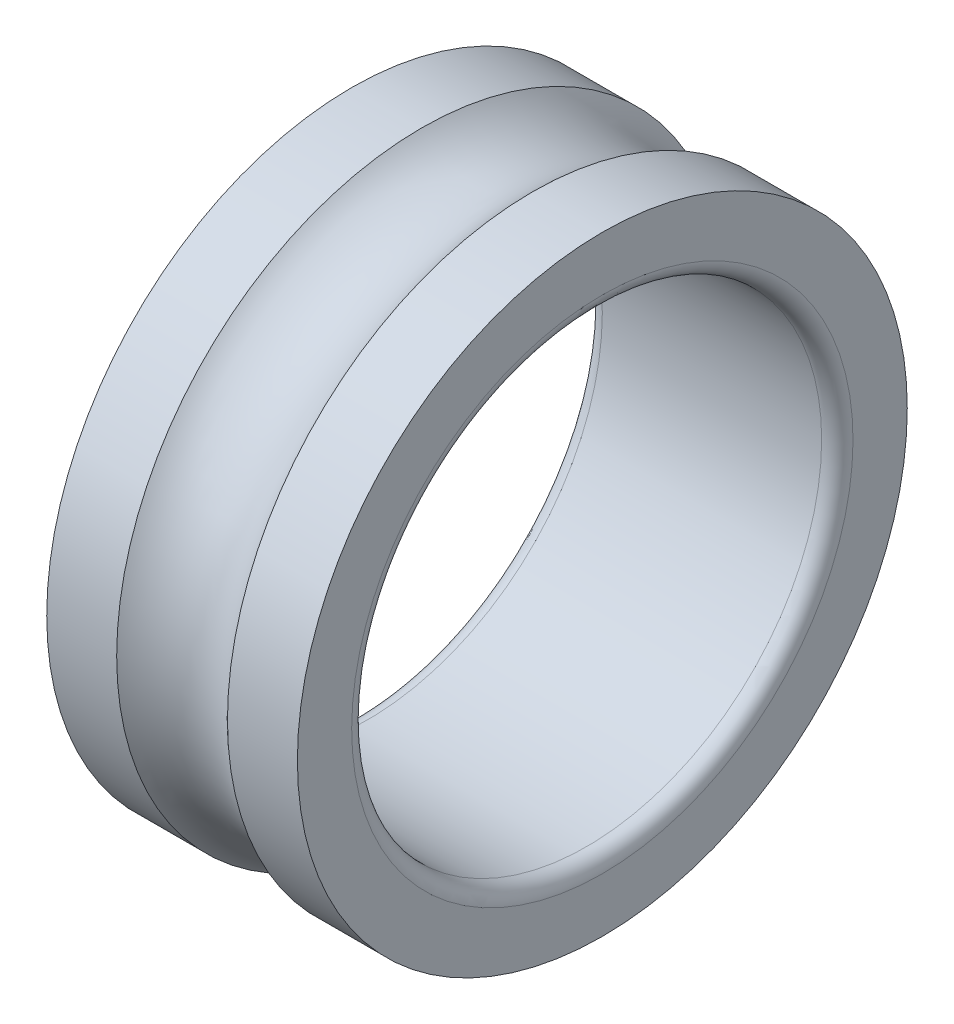
ISO-10303-21;
HEADER;
FILE_DESCRIPTION(('STEP AP214'),'2;1');
FILE_NAME('part.step','',(''),(''),'','','');
FILE_SCHEMA(('AUTOMOTIVE_DESIGN { 1 0 10303 214 1 1 1 1 }'));
ENDSEC;
DATA;
#1=APPLICATION_CONTEXT('core data for automotive mechanical design processes');
#2=APPLICATION_PROTOCOL_DEFINITION('international standard','automotive_design',2000,#1);
#3=PRODUCT_CONTEXT('',#1,'mechanical');
#4=PRODUCT('Part','Part','',(#3));
#5=PRODUCT_RELATED_PRODUCT_CATEGORY('part','',(#4));
#6=PRODUCT_DEFINITION_FORMATION('','',#4);
#7=PRODUCT_DEFINITION_CONTEXT('part definition',#1,'design');
#8=PRODUCT_DEFINITION('design','',#6,#7);
#9=PRODUCT_DEFINITION_SHAPE('','',#8);
#10=(LENGTH_UNIT() NAMED_UNIT(*) SI_UNIT(.MILLI.,.METRE.));
#11=(NAMED_UNIT(*) PLANE_ANGLE_UNIT() SI_UNIT($,.RADIAN.));
#12=(NAMED_UNIT(*) SI_UNIT($,.STERADIAN.) SOLID_ANGLE_UNIT());
#13=UNCERTAINTY_MEASURE_WITH_UNIT(LENGTH_MEASURE(1.E-05),#10,'distance_accuracy_value','');
#14=(GEOMETRIC_REPRESENTATION_CONTEXT(3) GLOBAL_UNCERTAINTY_ASSIGNED_CONTEXT((#13)) GLOBAL_UNIT_ASSIGNED_CONTEXT((#10,
#11,#12)) REPRESENTATION_CONTEXT('',''));
#15=CARTESIAN_POINT('',(0.,0.,0.));
#16=DIRECTION('',(0.,0.,1.));
#17=DIRECTION('',(1.,0.,0.));
#18=AXIS2_PLACEMENT_3D('',#15,#16,#17);
#19=CARTESIAN_POINT('',(25.9943089574791,0.,0.));
#20=DIRECTION('',(-1.,0.,0.));
#21=DIRECTION('',(0.,0.877582561890372,-0.479425538604204));
#22=AXIS2_PLACEMENT_3D('',#19,#20,#21);
#23=TOROIDAL_SURFACE('',#22,23.,5.);
#24=CARTESIAN_POINT('',(22.4587750515691,0.,0.));
#25=DIRECTION('',(1.,0.,0.));
#26=DIRECTION('',(0.,0.,-1.));
#27=AXIS2_PLACEMENT_3D('',#24,#25,#26);
#28=CIRCLE('',#27,19.4644660941);
#29=CARTESIAN_POINT('',(22.4587750515691,0.,-19.4644660941));
#30=VERTEX_POINT('',#29);
#31=EDGE_CURVE('E258',#30,#30,#28,.F.);
#32=ORIENTED_EDGE('',*,*,#31,.F.);
#33=EDGE_LOOP('',(#32));
#34=FACE_BOUND('',#33,.T.);
#35=CARTESIAN_POINT('',(29.5298428634091,0.,0.));
#36=DIRECTION('',(1.,0.,0.));
#37=DIRECTION('',(0.,0.,-1.));
#38=AXIS2_PLACEMENT_3D('',#35,#36,#37);
#39=CIRCLE('',#38,19.4644660941);
#40=CARTESIAN_POINT('',(29.5298428634091,0.,-19.4644660941));
#41=VERTEX_POINT('',#40);
#42=EDGE_CURVE('E255',#41,#41,#39,.T.);
#43=ORIENTED_EDGE('',*,*,#42,.F.);
#44=EDGE_LOOP('',(#43));
#45=FACE_BOUND('',#44,.T.);
#46=ADVANCED_FACE('F17',(#34,#45),#23,.F.);
#47=CARTESIAN_POINT('',(25.9943089573691,0.,0.));
#48=DIRECTION('',(1.,0.,0.));
#49=DIRECTION('',(0.,0.,-1.));
#50=AXIS2_PLACEMENT_3D('',#47,#48,#49);
#51=CYLINDRICAL_SURFACE('',#50,19.4644660941);
#52=CARTESIAN_POINT('',(17.9943089574691,0.,0.));
#53=DIRECTION('',(1.,0.,0.));
#54=DIRECTION('',(0.,0.,-1.));
#55=AXIS2_PLACEMENT_3D('',#52,#53,#54);
#56=CIRCLE('',#55,19.4644660941);
#57=CARTESIAN_POINT('',(17.9943089574691,0.,-19.4644660941));
#58=VERTEX_POINT('',#57);
#59=EDGE_CURVE('E252',#58,#58,#56,.F.);
#60=ORIENTED_EDGE('',*,*,#59,.F.);
#61=EDGE_LOOP('',(#60));
#62=FACE_BOUND('',#61,.T.);
#63=ORIENTED_EDGE('',*,*,#31,.T.);
#64=EDGE_LOOP('',(#63));
#65=FACE_BOUND('',#64,.T.);
#66=ADVANCED_FACE('F130',(#62,#65),#51,.T.);
#67=CARTESIAN_POINT('',(25.9943089573691,0.,0.));
#68=DIRECTION('',(1.,0.,0.));
#69=DIRECTION('',(0.,0.,-1.));
#70=AXIS2_PLACEMENT_3D('',#67,#68,#69);
#71=CYLINDRICAL_SURFACE('',#70,19.4644660941);
#72=ORIENTED_EDGE('',*,*,#42,.T.);
#73=EDGE_LOOP('',(#72));
#74=FACE_BOUND('',#73,.T.);
#75=CARTESIAN_POINT('',(33.9943089574791,0.,0.));
#76=DIRECTION('',(1.,0.,0.));
#77=DIRECTION('',(0.,0.,-1.));
#78=AXIS2_PLACEMENT_3D('',#75,#76,#77);
#79=CIRCLE('',#78,19.4644660941);
#80=CARTESIAN_POINT('',(33.9943089574791,0.,-19.4644660941));
#81=VERTEX_POINT('',#80);
#82=EDGE_CURVE('E250',#81,#81,#79,.F.);
#83=ORIENTED_EDGE('',*,*,#82,.T.);
#84=EDGE_LOOP('',(#83));
#85=FACE_BOUND('',#84,.T.);
#86=ADVANCED_FACE('F127',(#74,#85),#71,.T.);
#87=CARTESIAN_POINT('',(17.9943089574691,30.,0.));
#88=DIRECTION('',(-1.,0.,0.));
#89=DIRECTION('',(0.,0.,1.));
#90=AXIS2_PLACEMENT_3D('',#87,#88,#89);
#91=PLANE('',#90);
#92=CARTESIAN_POINT('',(17.9943089574691,0.,0.));
#93=DIRECTION('',(-1.,0.,0.));
#94=DIRECTION('',(0.,-0.877582561891139,0.479425538602801));
#95=AXIS2_PLACEMENT_3D('',#92,#93,#94);
#96=CIRCLE('',#95,16.0000000000244);
#97=CARTESIAN_POINT('',(17.9943089574691,-14.0413209902833,7.67080861765993));
#98=VERTEX_POINT('',#97);
#99=CARTESIAN_POINT('',(17.9943089574691,14.0413209902545,-7.67080861767194));
#100=VERTEX_POINT('',#99);
#101=EDGE_CURVE('E53',#98,#100,#96,.T.);
#102=ORIENTED_EDGE('',*,*,#101,.F.);
#103=CARTESIAN_POINT('',(17.9943089574691,0.,0.));
#104=DIRECTION('',(-1.,0.,0.));
#105=DIRECTION('',(0.,0.877582561890372,-0.479425538604204));
#106=AXIS2_PLACEMENT_3D('',#103,#104,#105);
#107=CIRCLE('',#106,16.);
#108=EDGE_CURVE('E48',#100,#98,#107,.T.);
#109=ORIENTED_EDGE('',*,*,#108,.F.);
#110=EDGE_LOOP('',(#102,#109));
#111=FACE_BOUND('',#110,.T.);
#112=ORIENTED_EDGE('',*,*,#59,.T.);
#113=EDGE_LOOP('',(#112));
#114=FACE_BOUND('',#113,.T.);
#115=ADVANCED_FACE('F51',(#111,#114),#91,.T.);
#116=CARTESIAN_POINT('',(33.9943089574791,26.5355339059,0.));
#117=DIRECTION('',(-1.,0.,0.));
#118=DIRECTION('',(0.,0.,1.));
#119=AXIS2_PLACEMENT_3D('',#116,#117,#118);
#120=PLANE('',#119);
#121=CARTESIAN_POINT('',(33.9943089574791,0.,0.));
#122=DIRECTION('',(1.,0.,0.));
#123=DIRECTION('',(0.,0.877582561890372,-0.479425538604204));
#124=AXIS2_PLACEMENT_3D('',#121,#122,#123);
#125=CIRCLE('',#124,15.9999999999805);
#126=CARTESIAN_POINT('',(33.9943089574791,14.0413209902207,-7.67080861766462));
#127=VERTEX_POINT('',#126);
#128=CARTESIAN_POINT('',(33.9943089574791,-14.0413209902431,7.67080861766027));
#129=VERTEX_POINT('',#128);
#130=EDGE_CURVE('E35',#127,#129,#125,.T.);
#131=ORIENTED_EDGE('',*,*,#130,.F.);
#132=CARTESIAN_POINT('',(33.9943089574791,0.,0.));
#133=DIRECTION('',(1.,0.,0.));
#134=DIRECTION('',(0.,-0.877582561890729,0.47942553860355));
#135=AXIS2_PLACEMENT_3D('',#132,#133,#134);
#136=CIRCLE('',#135,16.);
#137=EDGE_CURVE('E39',#129,#127,#136,.T.);
#138=ORIENTED_EDGE('',*,*,#137,.F.);
#139=EDGE_LOOP('',(#131,#138));
#140=FACE_BOUND('',#139,.T.);
#141=ORIENTED_EDGE('',*,*,#82,.F.);
#142=EDGE_LOOP('',(#141));
#143=FACE_BOUND('',#142,.T.);
#144=ADVANCED_FACE('F79',(#140,#143),#120,.F.);
#145=CARTESIAN_POINT('',(18.9943089574691,0.,0.));
#146=DIRECTION('',(-1.,0.,0.));
#147=DIRECTION('',(0.,0.877582561890372,-0.479425538604204));
#148=AXIS2_PLACEMENT_3D('',#145,#146,#147);
#149=TOROIDAL_SURFACE('',#148,16.,1.);
#150=CARTESIAN_POINT('',(18.9943100751691,0.,0.));
#151=DIRECTION('',(1.,0.,0.));
#152=DIRECTION('',(0.,0.,-1.));
#153=AXIS2_PLACEMENT_3D('',#150,#151,#152);
#154=CIRCLE('',#153,15.0000011177);
#155=CARTESIAN_POINT('',(18.9943100751691,0.,-15.0000011177));
#156=VERTEX_POINT('',#155);
#157=EDGE_CURVE('E28',#156,#156,#154,.T.);
#158=ORIENTED_EDGE('',*,*,#157,.T.);
#159=EDGE_LOOP('',(#158));
#160=FACE_BOUND('',#159,.T.);
#161=ORIENTED_EDGE('',*,*,#101,.T.);
#162=ORIENTED_EDGE('',*,*,#108,.T.);
#163=EDGE_LOOP('',(#161,#162));
#164=FACE_BOUND('',#163,.T.);
#165=ADVANCED_FACE('F59',(#160,#164),#149,.T.);
#166=CARTESIAN_POINT('',(32.9943089574791,0.,0.));
#167=DIRECTION('',(-1.,0.,0.));
#168=DIRECTION('',(0.,0.877582561890372,-0.479425538604204));
#169=AXIS2_PLACEMENT_3D('',#166,#167,#168);
#170=TOROIDAL_SURFACE('',#169,16.,1.);
#171=ORIENTED_EDGE('',*,*,#137,.T.);
#172=ORIENTED_EDGE('',*,*,#130,.T.);
#173=EDGE_LOOP('',(#171,#172));
#174=FACE_BOUND('',#173,.T.);
#175=CARTESIAN_POINT('',(32.9943100751891,0.,0.));
#176=DIRECTION('',(1.,0.,0.));
#177=DIRECTION('',(0.,0.,-1.));
#178=AXIS2_PLACEMENT_3D('',#175,#176,#177);
#179=CIRCLE('',#178,15.0000011177);
#180=CARTESIAN_POINT('',(32.9943100751891,0.,-15.0000011177));
#181=VERTEX_POINT('',#180);
#182=EDGE_CURVE('E11',#181,#181,#179,.F.);
#183=ORIENTED_EDGE('',*,*,#182,.T.);
#184=EDGE_LOOP('',(#183));
#185=FACE_BOUND('',#184,.T.);
#186=ADVANCED_FACE('F78',(#174,#185),#170,.T.);
#187=CARTESIAN_POINT('',(25.9943089573691,0.,0.));
#188=DIRECTION('',(1.,0.,0.));
#189=DIRECTION('',(0.,0.,-1.));
#190=AXIS2_PLACEMENT_3D('',#187,#188,#189);
#191=CYLINDRICAL_SURFACE('',#190,15.0000011177);
#192=ORIENTED_EDGE('',*,*,#182,.F.);
#193=EDGE_LOOP('',(#192));
#194=FACE_BOUND('',#193,.T.);
#195=ORIENTED_EDGE('',*,*,#157,.F.);
#196=EDGE_LOOP('',(#195));
#197=FACE_BOUND('',#196,.T.);
#198=ADVANCED_FACE('F141',(#194,#197),#191,.F.);
#199=CLOSED_SHELL('',(#46,#66,#86,#115,#144,#165,#186,#198));
#200=MANIFOLD_SOLID_BREP('B1',#199);
#201=ADVANCED_BREP_SHAPE_REPRESENTATION('',(#18,#200),#14);
#202=SHAPE_DEFINITION_REPRESENTATION(#9,#201);
ENDSEC;
END-ISO-10303-21;
